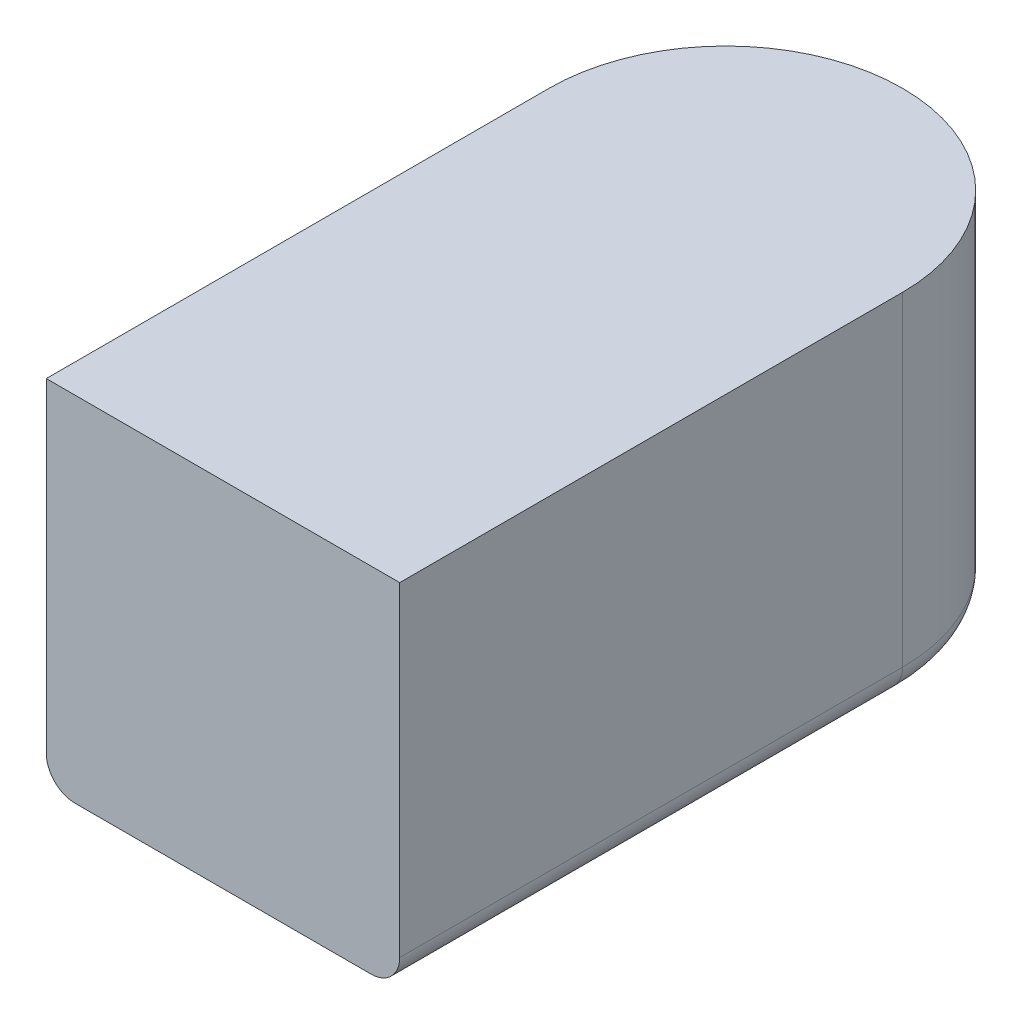
ISO-10303-21;
HEADER;
FILE_DESCRIPTION(('STEP AP214'),'2;1');
FILE_NAME('part.step','',(''),(''),'','','');
FILE_SCHEMA(('AUTOMOTIVE_DESIGN { 1 0 10303 214 1 1 1 1 }'));
ENDSEC;
DATA;
#1=APPLICATION_CONTEXT('core data for automotive mechanical design processes');
#2=APPLICATION_PROTOCOL_DEFINITION('international standard','automotive_design',2000,#1);
#3=PRODUCT_CONTEXT('',#1,'mechanical');
#4=PRODUCT('Part','Part','',(#3));
#5=PRODUCT_RELATED_PRODUCT_CATEGORY('part','',(#4));
#6=PRODUCT_DEFINITION_FORMATION('','',#4);
#7=PRODUCT_DEFINITION_CONTEXT('part definition',#1,'design');
#8=PRODUCT_DEFINITION('design','',#6,#7);
#9=PRODUCT_DEFINITION_SHAPE('','',#8);
#10=(LENGTH_UNIT() NAMED_UNIT(*) SI_UNIT(.MILLI.,.METRE.));
#11=(NAMED_UNIT(*) PLANE_ANGLE_UNIT() SI_UNIT($,.RADIAN.));
#12=(NAMED_UNIT(*) SI_UNIT($,.STERADIAN.) SOLID_ANGLE_UNIT());
#13=UNCERTAINTY_MEASURE_WITH_UNIT(LENGTH_MEASURE(1.E-05),#10,'distance_accuracy_value','');
#14=(GEOMETRIC_REPRESENTATION_CONTEXT(3) GLOBAL_UNCERTAINTY_ASSIGNED_CONTEXT((#13)) GLOBAL_UNIT_ASSIGNED_CONTEXT((#10,
#11,#12)) REPRESENTATION_CONTEXT('',''));
#15=CARTESIAN_POINT('',(0.,0.,0.));
#16=DIRECTION('',(0.,0.,1.));
#17=DIRECTION('',(1.,0.,0.));
#18=AXIS2_PLACEMENT_3D('',#15,#16,#17);
#19=CARTESIAN_POINT('',(-10.3,1.99999999999604,10.4));
#20=DIRECTION('',(0.,0.,1.));
#21=DIRECTION('',(1.,0.,0.));
#22=AXIS2_PLACEMENT_3D('',#19,#20,#21);
#23=CYLINDRICAL_SURFACE('',#22,2.);
#24=DIRECTION('',(0.,0.,1.));
#25=VECTOR('',#24,1.);
#26=CARTESIAN_POINT('',(-12.3,1.99999999999604,35.));
#27=LINE('',#26,#25);
#28=CARTESIAN_POINT('',(-12.2999999999994,2.00000000000311,-1.28094812718021E-13));
#29=VERTEX_POINT('',#28);
#30=CARTESIAN_POINT('',(-12.3,1.99999999999604,35.));
#31=VERTEX_POINT('',#30);
#32=EDGE_CURVE('E179',#29,#31,#27,.T.);
#33=ORIENTED_EDGE('',*,*,#32,.F.);
#34=CARTESIAN_POINT('',(-10.2999999999994,2.00000000000261,-1.26638278578844E-13));
#35=DIRECTION('',(0.,0.,-1.));
#36=DIRECTION('',(-1.,2.53075338463287E-13,0.));
#37=AXIS2_PLACEMENT_3D('',#34,#35,#36);
#38=CIRCLE('',#37,2.);
#39=CARTESIAN_POINT('',(-10.3,2.60208521396521E-12,0.));
#40=VERTEX_POINT('',#39);
#41=EDGE_CURVE('E91',#40,#29,#38,.T.);
#42=ORIENTED_EDGE('',*,*,#41,.F.);
#43=DIRECTION('',(0.,0.,1.));
#44=VECTOR('',#43,1.);
#45=CARTESIAN_POINT('',(-10.3,-3.96247309414794E-12,35.));
#46=LINE('',#45,#44);
#47=CARTESIAN_POINT('',(-10.3,-3.96247309414794E-12,35.));
#48=VERTEX_POINT('',#47);
#49=EDGE_CURVE('E95',#40,#48,#46,.T.);
#50=ORIENTED_EDGE('',*,*,#49,.T.);
#51=CARTESIAN_POINT('',(-10.3,1.99999999999604,35.));
#52=DIRECTION('',(0.,0.,1.));
#53=DIRECTION('',(1.,0.,0.));
#54=AXIS2_PLACEMENT_3D('',#51,#52,#53);
#55=CIRCLE('',#54,2.);
#56=EDGE_CURVE('E53',#48,#31,#55,.F.);
#57=ORIENTED_EDGE('',*,*,#56,.T.);
#58=EDGE_LOOP('',(#33,#42,#50,#57));
#59=FACE_BOUND('',#58,.T.);
#60=ADVANCED_FACE('F16',(#59),#23,.T.);
#61=CARTESIAN_POINT('',(10.3,1.99999999999604,10.4));
#62=DIRECTION('',(0.,0.,1.));
#63=DIRECTION('',(1.,0.,0.));
#64=AXIS2_PLACEMENT_3D('',#61,#62,#63);
#65=CYLINDRICAL_SURFACE('',#64,2.);
#66=DIRECTION('',(0.,0.,1.));
#67=VECTOR('',#66,1.);
#68=CARTESIAN_POINT('',(10.3,-3.96247309414794E-12,35.));
#69=LINE('',#68,#67);
#70=CARTESIAN_POINT('',(10.3,-3.96247309414794E-12,35.));
#71=VERTEX_POINT('',#70);
#72=CARTESIAN_POINT('',(10.3,-2.60902410786912E-12,0.));
#73=VERTEX_POINT('',#72);
#74=EDGE_CURVE('E97',#71,#73,#69,.F.);
#75=ORIENTED_EDGE('',*,*,#74,.T.);
#76=CARTESIAN_POINT('',(10.3000000000005,1.99999999999739,-1.32473741984737E-13));
#77=DIRECTION('',(0.,0.,1.));
#78=DIRECTION('',(1.,-2.53075338463287E-13,0.));
#79=AXIS2_PLACEMENT_3D('',#76,#77,#78);
#80=CIRCLE('',#79,2.);
#81=CARTESIAN_POINT('',(12.3000000000006,1.99999999999688,-1.32386221940586E-13));
#82=VERTEX_POINT('',#81);
#83=EDGE_CURVE('E191',#82,#73,#80,.F.);
#84=ORIENTED_EDGE('',*,*,#83,.F.);
#85=DIRECTION('',(0.,0.,-1.));
#86=VECTOR('',#85,1.);
#87=CARTESIAN_POINT('',(12.3,1.99999999999604,35.));
#88=LINE('',#87,#86);
#89=CARTESIAN_POINT('',(12.3,1.99999999999604,35.));
#90=VERTEX_POINT('',#89);
#91=EDGE_CURVE('E76',#90,#82,#88,.T.);
#92=ORIENTED_EDGE('',*,*,#91,.F.);
#93=CARTESIAN_POINT('',(10.3,1.99999999999604,35.));
#94=DIRECTION('',(0.,0.,1.));
#95=DIRECTION('',(1.,0.,0.));
#96=AXIS2_PLACEMENT_3D('',#93,#94,#95);
#97=CIRCLE('',#96,2.);
#98=EDGE_CURVE('E109',#90,#71,#97,.F.);
#99=ORIENTED_EDGE('',*,*,#98,.T.);
#100=EDGE_LOOP('',(#75,#84,#92,#99));
#101=FACE_BOUND('',#100,.T.);
#102=ADVANCED_FACE('F149',(#101),#65,.T.);
#103=CARTESIAN_POINT('',(-12.3,-3.96247309414794E-12,35.));
#104=DIRECTION('',(0.,1.,0.));
#105=DIRECTION('',(0.,0.,1.));
#106=AXIS2_PLACEMENT_3D('',#103,#104,#105);
#107=PLANE('',#106);
#108=ORIENTED_EDGE('',*,*,#74,.F.);
#109=DIRECTION('',(-1.,0.,0.));
#110=VECTOR('',#109,1.);
#111=CARTESIAN_POINT('',(-12.3,-3.96247309414794E-12,35.));
#112=LINE('',#111,#110);
#113=EDGE_CURVE('E106',#71,#48,#112,.T.);
#114=ORIENTED_EDGE('',*,*,#113,.T.);
#115=ORIENTED_EDGE('',*,*,#49,.F.);
#116=CARTESIAN_POINT('',(0.,0.,0.));
#117=DIRECTION('',(2.53075338463287E-13,1.,0.));
#118=DIRECTION('',(1.,-2.53092786749917E-13,0.));
#119=AXIS2_PLACEMENT_3D('',#116,#117,#118);
#120=CIRCLE('',#119,10.3);
#121=EDGE_CURVE('E131',#73,#40,#120,.T.);
#122=ORIENTED_EDGE('',*,*,#121,.F.);
#123=EDGE_LOOP('',(#108,#114,#115,#122));
#124=FACE_BOUND('',#123,.T.);
#125=ADVANCED_FACE('F138',(#124),#107,.F.);
#126=CARTESIAN_POINT('',(-12.3,-3.96247309414794E-12,35.));
#127=DIRECTION('',(-1.,0.,0.));
#128=DIRECTION('',(0.,0.,1.));
#129=AXIS2_PLACEMENT_3D('',#126,#127,#128);
#130=PLANE('',#129);
#131=DIRECTION('',(0.,1.,0.));
#132=VECTOR('',#131,1.);
#133=CARTESIAN_POINT('',(-12.3,-3.96247309414794E-12,35.));
#134=LINE('',#133,#132);
#135=CARTESIAN_POINT('',(-12.3,24.599999999996,35.));
#136=VERTEX_POINT('',#135);
#137=EDGE_CURVE('E111',#31,#136,#134,.T.);
#138=ORIENTED_EDGE('',*,*,#137,.T.);
#139=DIRECTION('',(0.,0.,1.));
#140=VECTOR('',#139,1.);
#141=CARTESIAN_POINT('',(-12.3,24.599999999996,35.));
#142=LINE('',#141,#140);
#143=CARTESIAN_POINT('',(-12.2999999999937,24.6000000000031,-1.45833878825643E-12));
#144=VERTEX_POINT('',#143);
#145=EDGE_CURVE('E61',#136,#144,#142,.F.);
#146=ORIENTED_EDGE('',*,*,#145,.T.);
#147=DIRECTION('',(2.53075338463287E-13,1.,0.));
#148=VECTOR('',#147,1.);
#149=CARTESIAN_POINT('',(-12.2999999999994,2.00000000000311,-1.28576048727179E-13));
#150=LINE('',#149,#148);
#151=EDGE_CURVE('E94',#29,#144,#150,.T.);
#152=ORIENTED_EDGE('',*,*,#151,.F.);
#153=ORIENTED_EDGE('',*,*,#32,.T.);
#154=EDGE_LOOP('',(#138,#146,#152,#153));
#155=FACE_BOUND('',#154,.T.);
#156=ADVANCED_FACE('F148',(#155),#130,.T.);
#157=CARTESIAN_POINT('',(12.3,24.599999999996,35.));
#158=DIRECTION('',(1.,0.,0.));
#159=DIRECTION('',(0.,0.,-1.));
#160=AXIS2_PLACEMENT_3D('',#157,#158,#159);
#161=PLANE('',#160);
#162=ORIENTED_EDGE('',*,*,#91,.T.);
#163=DIRECTION('',(2.53075338463287E-13,1.,0.));
#164=VECTOR('',#163,1.);
#165=CARTESIAN_POINT('',(12.3000000000006,1.99999999999688,-1.32532080193133E-13));
#166=LINE('',#165,#164);
#167=CARTESIAN_POINT('',(12.3000000000063,24.5999999999969,-1.46304795262998E-12));
#168=VERTEX_POINT('',#167);
#169=EDGE_CURVE('E86',#168,#82,#166,.F.);
#170=ORIENTED_EDGE('',*,*,#169,.F.);
#171=DIRECTION('',(0.,0.,1.));
#172=VECTOR('',#171,1.);
#173=CARTESIAN_POINT('',(12.3,24.599999999996,35.));
#174=LINE('',#173,#172);
#175=CARTESIAN_POINT('',(12.3,24.599999999996,35.));
#176=VERTEX_POINT('',#175);
#177=EDGE_CURVE('E26',#168,#176,#174,.T.);
#178=ORIENTED_EDGE('',*,*,#177,.T.);
#179=DIRECTION('',(0.,1.,0.));
#180=VECTOR('',#179,1.);
#181=CARTESIAN_POINT('',(12.3,-3.96247309414794E-12,35.));
#182=LINE('',#181,#180);
#183=EDGE_CURVE('E34',#176,#90,#182,.F.);
#184=ORIENTED_EDGE('',*,*,#183,.T.);
#185=EDGE_LOOP('',(#162,#170,#178,#184));
#186=FACE_BOUND('',#185,.T.);
#187=ADVANCED_FACE('F87',(#186),#161,.T.);
#188=CARTESIAN_POINT('',(-12.3,-3.96247309414794E-12,35.));
#189=DIRECTION('',(0.,0.,-1.));
#190=DIRECTION('',(-1.,0.,0.));
#191=AXIS2_PLACEMENT_3D('',#188,#189,#190);
#192=PLANE('',#191);
#193=ORIENTED_EDGE('',*,*,#98,.F.);
#194=ORIENTED_EDGE('',*,*,#183,.F.);
#195=DIRECTION('',(1.,0.,0.));
#196=VECTOR('',#195,1.);
#197=CARTESIAN_POINT('',(12.3,24.599999999996,35.));
#198=LINE('',#197,#196);
#199=EDGE_CURVE('E11',#176,#136,#198,.F.);
#200=ORIENTED_EDGE('',*,*,#199,.T.);
#201=ORIENTED_EDGE('',*,*,#137,.F.);
#202=ORIENTED_EDGE('',*,*,#56,.F.);
#203=ORIENTED_EDGE('',*,*,#113,.F.);
#204=EDGE_LOOP('',(#193,#194,#200,#201,#202,#203));
#205=FACE_BOUND('',#204,.T.);
#206=ADVANCED_FACE('F154',(#205),#192,.F.);
#207=CARTESIAN_POINT('',(12.3,24.599999999996,35.));
#208=DIRECTION('',(0.,-1.,0.));
#209=DIRECTION('',(1.,0.,0.));
#210=AXIS2_PLACEMENT_3D('',#207,#208,#209);
#211=PLANE('',#210);
#212=ORIENTED_EDGE('',*,*,#177,.F.);
#213=CARTESIAN_POINT('',(6.27635225510342E-12,24.6,-1.4603168039894E-12));
#214=DIRECTION('',(2.53075338463287E-13,1.,0.));
#215=DIRECTION('',(1.,-2.53075338463287E-13,0.));
#216=AXIS2_PLACEMENT_3D('',#213,#214,#215);
#217=CIRCLE('',#216,12.3);
#218=EDGE_CURVE('E82',#144,#168,#217,.F.);
#219=ORIENTED_EDGE('',*,*,#218,.F.);
#220=ORIENTED_EDGE('',*,*,#145,.F.);
#221=ORIENTED_EDGE('',*,*,#199,.F.);
#222=EDGE_LOOP('',(#212,#219,#220,#221));
#223=FACE_BOUND('',#222,.T.);
#224=ADVANCED_FACE('F18',(#223),#211,.F.);
#225=CARTESIAN_POINT('',(5.56849605833141E-13,2.,-1.28925338009572E-13));
#226=DIRECTION('',(-2.53075338463287E-13,-1.,0.));
#227=DIRECTION('',(-1.,2.53075338463287E-13,0.));
#228=AXIS2_PLACEMENT_3D('',#225,#226,#227);
#229=TOROIDAL_SURFACE('',#228,10.3,2.);
#230=ORIENTED_EDGE('',*,*,#41,.T.);
#231=CARTESIAN_POINT('',(5.56849605833141E-13,2.,-1.29800931552555E-13));
#232=DIRECTION('',(2.53075338463287E-13,1.,0.));
#233=DIRECTION('',(1.,-2.53075338463287E-13,0.));
#234=AXIS2_PLACEMENT_3D('',#231,#232,#233);
#235=CIRCLE('',#234,12.3);
#236=EDGE_CURVE('E90',#82,#29,#235,.T.);
#237=ORIENTED_EDGE('',*,*,#236,.F.);
#238=ORIENTED_EDGE('',*,*,#83,.T.);
#239=ORIENTED_EDGE('',*,*,#121,.T.);
#240=EDGE_LOOP('',(#230,#237,#238,#239));
#241=FACE_BOUND('',#240,.T.);
#242=ADVANCED_FACE('F161',(#241),#229,.T.);
#243=CARTESIAN_POINT('',(5.56849605833141E-13,2.,-1.29800931552555E-13));
#244=DIRECTION('',(2.53075338463287E-13,1.,0.));
#245=DIRECTION('',(1.,-2.53075338463287E-13,0.));
#246=AXIS2_PLACEMENT_3D('',#243,#244,#245);
#247=CYLINDRICAL_SURFACE('',#246,12.3);
#248=ORIENTED_EDGE('',*,*,#151,.T.);
#249=ORIENTED_EDGE('',*,*,#218,.T.);
#250=ORIENTED_EDGE('',*,*,#169,.T.);
#251=ORIENTED_EDGE('',*,*,#236,.T.);
#252=EDGE_LOOP('',(#248,#249,#250,#251));
#253=FACE_BOUND('',#252,.T.);
#254=ADVANCED_FACE('F93',(#253),#247,.T.);
#255=CLOSED_SHELL('',(#60,#102,#125,#156,#187,#206,#224,#242,#254));
#256=MANIFOLD_SOLID_BREP('B1',#255);
#257=ADVANCED_BREP_SHAPE_REPRESENTATION('',(#18,#256),#14);
#258=SHAPE_DEFINITION_REPRESENTATION(#9,#257);
ENDSEC;
END-ISO-10303-21;
